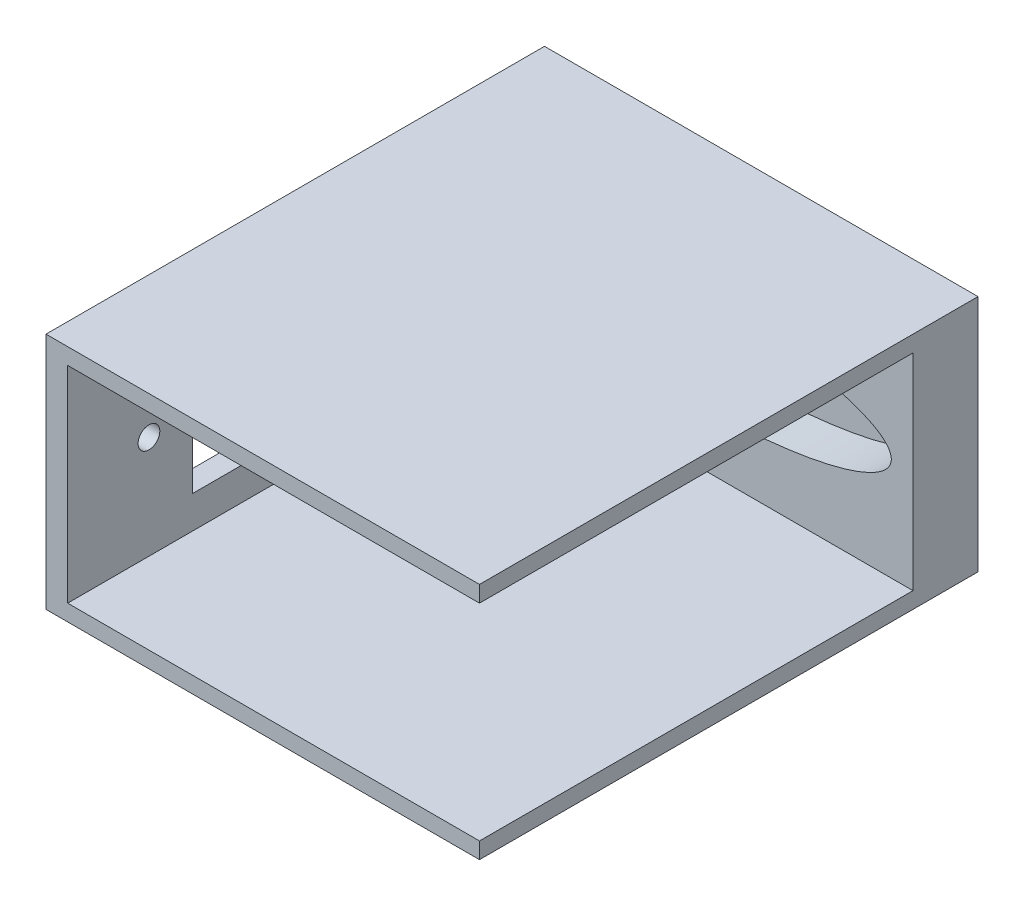
ISO-10303-21;
HEADER;
FILE_DESCRIPTION(('STEP AP214'),'2;1');
FILE_NAME('part.step','',(''),(''),'','','');
FILE_SCHEMA(('AUTOMOTIVE_DESIGN { 1 0 10303 214 1 1 1 1 }'));
ENDSEC;
DATA;
#1=APPLICATION_CONTEXT('core data for automotive mechanical design processes');
#2=APPLICATION_PROTOCOL_DEFINITION('international standard','automotive_design',2000,#1);
#3=PRODUCT_CONTEXT('',#1,'mechanical');
#4=PRODUCT('Part','Part','',(#3));
#5=PRODUCT_RELATED_PRODUCT_CATEGORY('part','',(#4));
#6=PRODUCT_DEFINITION_FORMATION('','',#4);
#7=PRODUCT_DEFINITION_CONTEXT('part definition',#1,'design');
#8=PRODUCT_DEFINITION('design','',#6,#7);
#9=PRODUCT_DEFINITION_SHAPE('','',#8);
#10=(LENGTH_UNIT() NAMED_UNIT(*) SI_UNIT(.MILLI.,.METRE.));
#11=(NAMED_UNIT(*) PLANE_ANGLE_UNIT() SI_UNIT($,.RADIAN.));
#12=(NAMED_UNIT(*) SI_UNIT($,.STERADIAN.) SOLID_ANGLE_UNIT());
#13=UNCERTAINTY_MEASURE_WITH_UNIT(LENGTH_MEASURE(1.E-05),#10,'distance_accuracy_value','');
#14=(GEOMETRIC_REPRESENTATION_CONTEXT(3) GLOBAL_UNCERTAINTY_ASSIGNED_CONTEXT((#13)) GLOBAL_UNIT_ASSIGNED_CONTEXT((#10,
#11,#12)) REPRESENTATION_CONTEXT('',''));
#15=CARTESIAN_POINT('',(0.,0.,0.));
#16=DIRECTION('',(0.,0.,1.));
#17=DIRECTION('',(1.,0.,0.));
#18=AXIS2_PLACEMENT_3D('',#15,#16,#17);
#19=CARTESIAN_POINT('',(0.,0.,6.));
#20=DIRECTION('',(0.,0.,1.));
#21=DIRECTION('',(1.,0.,0.));
#22=AXIS2_PLACEMENT_3D('',#19,#20,#21);
#23=PLANE('',#22);
#24=DIRECTION('',(0.,1.,0.));
#25=VECTOR('',#24,1.);
#26=CARTESIAN_POINT('',(20.,0.,6.));
#27=LINE('',#26,#25);
#28=CARTESIAN_POINT('',(20.,-9.5,6.));
#29=VERTEX_POINT('',#28);
#30=CARTESIAN_POINT('',(20.,9.5,6.));
#31=VERTEX_POINT('',#30);
#32=EDGE_CURVE('E311',#29,#31,#27,.T.);
#33=ORIENTED_EDGE('',*,*,#32,.T.);
#34=DIRECTION('',(-1.,0.,0.));
#35=VECTOR('',#34,1.);
#36=CARTESIAN_POINT('',(20.,9.5,6.));
#37=LINE('',#36,#35);
#38=CARTESIAN_POINT('',(0.,9.5,6.));
#39=VERTEX_POINT('',#38);
#40=EDGE_CURVE('E205',#31,#39,#37,.T.);
#41=ORIENTED_EDGE('',*,*,#40,.T.);
#42=CARTESIAN_POINT('',(0.,0.,6.));
#43=DIRECTION('',(0.,0.,1.));
#44=DIRECTION('',(0.,1.,0.));
#45=AXIS2_PLACEMENT_3D('',#42,#43,#44);
#46=ELLIPSE('',#45,9.5,4.5);
#47=CARTESIAN_POINT('',(3.99121071229722,4.38798243109834,6.));
#48=VERTEX_POINT('',#47);
#49=EDGE_CURVE('E269',#48,#39,#46,.T.);
#50=ORIENTED_EDGE('',*,*,#49,.F.);
#51=CARTESIAN_POINT('',(0.,0.,6.));
#52=DIRECTION('',(0.,0.,1.));
#53=DIRECTION('',(1.,0.,0.));
#54=AXIS2_PLACEMENT_3D('',#51,#52,#53);
#55=ELLIPSE('',#54,18.,4.5);
#56=CARTESIAN_POINT('',(3.99121071229722,-4.38798243109834,6.));
#57=VERTEX_POINT('',#56);
#58=EDGE_CURVE('E441',#57,#48,#55,.T.);
#59=ORIENTED_EDGE('',*,*,#58,.F.);
#60=CARTESIAN_POINT('',(0.,0.,6.));
#61=DIRECTION('',(0.,0.,1.));
#62=DIRECTION('',(0.,1.,0.));
#63=AXIS2_PLACEMENT_3D('',#60,#61,#62);
#64=ELLIPSE('',#63,9.5,4.5);
#65=CARTESIAN_POINT('',(0.,-9.5,6.));
#66=VERTEX_POINT('',#65);
#67=EDGE_CURVE('E436',#66,#57,#64,.T.);
#68=ORIENTED_EDGE('',*,*,#67,.F.);
#69=DIRECTION('',(-1.,0.,0.));
#70=VECTOR('',#69,1.);
#71=CARTESIAN_POINT('',(20.,-9.5,6.));
#72=LINE('',#71,#70);
#73=EDGE_CURVE('E195',#29,#66,#72,.T.);
#74=ORIENTED_EDGE('',*,*,#73,.F.);
#75=EDGE_LOOP('',(#33,#41,#50,#59,#68,#74));
#76=FACE_BOUND('',#75,.T.);
#77=ADVANCED_FACE('F39',(#76),#23,.T.);
#78=CARTESIAN_POINT('',(-3.99121071229722,4.38798243109834,6.));
#79=VERTEX_POINT('',#78);
#80=EDGE_CURVE('E445',#39,#79,#46,.T.);
#81=ORIENTED_EDGE('',*,*,#80,.F.);
#82=CARTESIAN_POINT('',(-18.,9.5,6.));
#83=VERTEX_POINT('',#82);
#84=EDGE_CURVE('E242',#39,#83,#37,.T.);
#85=ORIENTED_EDGE('',*,*,#84,.T.);
#86=DIRECTION('',(0.,1.,0.));
#87=VECTOR('',#86,1.);
#88=CARTESIAN_POINT('',(-18.,-9.5,6.));
#89=LINE('',#88,#87);
#90=CARTESIAN_POINT('',(-18.,0.,6.));
#91=VERTEX_POINT('',#90);
#92=EDGE_CURVE('E239',#91,#83,#89,.T.);
#93=ORIENTED_EDGE('',*,*,#92,.F.);
#94=CARTESIAN_POINT('',(0.,0.,6.));
#95=DIRECTION('',(0.,0.,1.));
#96=DIRECTION('',(1.,0.,0.));
#97=AXIS2_PLACEMENT_3D('',#94,#95,#96);
#98=ELLIPSE('',#97,18.,4.5);
#99=EDGE_CURVE('E432',#79,#91,#98,.T.);
#100=ORIENTED_EDGE('',*,*,#99,.F.);
#101=EDGE_LOOP('',(#81,#85,#93,#100));
#102=FACE_BOUND('',#101,.T.);
#103=ADVANCED_FACE('F286',(#102),#23,.T.);
#104=CARTESIAN_POINT('',(0.,-11.,6.));
#105=DIRECTION('',(0.,1.,0.));
#106=DIRECTION('',(0.,0.,1.));
#107=AXIS2_PLACEMENT_3D('',#104,#105,#106);
#108=PLANE('',#107);
#109=DIRECTION('',(1.,0.,0.));
#110=VECTOR('',#109,1.);
#111=CARTESIAN_POINT('',(0.,-11.,0.));
#112=LINE('',#111,#110);
#113=CARTESIAN_POINT('',(-20.,-11.,0.));
#114=VERTEX_POINT('',#113);
#115=CARTESIAN_POINT('',(20.,-11.,0.));
#116=VERTEX_POINT('',#115);
#117=EDGE_CURVE('E453',#114,#116,#112,.T.);
#118=ORIENTED_EDGE('',*,*,#117,.T.);
#119=DIRECTION('',(0.,0.,-1.));
#120=VECTOR('',#119,1.);
#121=CARTESIAN_POINT('',(20.,-11.,6.));
#122=LINE('',#121,#120);
#123=CARTESIAN_POINT('',(20.,-11.,46.));
#124=VERTEX_POINT('',#123);
#125=EDGE_CURVE('E336',#124,#116,#122,.T.);
#126=ORIENTED_EDGE('',*,*,#125,.F.);
#127=DIRECTION('',(-1.,0.,0.));
#128=VECTOR('',#127,1.);
#129=CARTESIAN_POINT('',(20.,-11.,46.));
#130=LINE('',#129,#128);
#131=CARTESIAN_POINT('',(-20.,-11.,46.));
#132=VERTEX_POINT('',#131);
#133=EDGE_CURVE('E209',#124,#132,#130,.T.);
#134=ORIENTED_EDGE('',*,*,#133,.T.);
#135=DIRECTION('',(0.,0.,-1.));
#136=VECTOR('',#135,1.);
#137=CARTESIAN_POINT('',(-20.,-11.,6.));
#138=LINE('',#137,#136);
#139=EDGE_CURVE('E318',#132,#114,#138,.T.);
#140=ORIENTED_EDGE('',*,*,#139,.T.);
#141=EDGE_LOOP('',(#118,#126,#134,#140));
#142=FACE_BOUND('',#141,.T.);
#143=ADVANCED_FACE('F41',(#142),#108,.F.);
#144=CARTESIAN_POINT('',(20.,0.,6.));
#145=DIRECTION('',(-1.,0.,0.));
#146=DIRECTION('',(0.,0.,1.));
#147=AXIS2_PLACEMENT_3D('',#144,#145,#146);
#148=PLANE('',#147);
#149=DIRECTION('',(0.,1.,0.));
#150=VECTOR('',#149,1.);
#151=CARTESIAN_POINT('',(20.,0.,0.));
#152=LINE('',#151,#150);
#153=CARTESIAN_POINT('',(20.,11.,0.));
#154=VERTEX_POINT('',#153);
#155=EDGE_CURVE('E466',#116,#154,#152,.T.);
#156=ORIENTED_EDGE('',*,*,#155,.T.);
#157=DIRECTION('',(0.,0.,-1.));
#158=VECTOR('',#157,1.);
#159=CARTESIAN_POINT('',(20.,11.,6.));
#160=LINE('',#159,#158);
#161=CARTESIAN_POINT('',(20.,11.,46.));
#162=VERTEX_POINT('',#161);
#163=EDGE_CURVE('E341',#162,#154,#160,.T.);
#164=ORIENTED_EDGE('',*,*,#163,.F.);
#165=DIRECTION('',(0.,-1.,0.));
#166=VECTOR('',#165,1.);
#167=CARTESIAN_POINT('',(20.,11.,46.));
#168=LINE('',#167,#166);
#169=CARTESIAN_POINT('',(20.,9.5,46.));
#170=VERTEX_POINT('',#169);
#171=EDGE_CURVE('E226',#162,#170,#168,.T.);
#172=ORIENTED_EDGE('',*,*,#171,.T.);
#173=DIRECTION('',(0.,0.,-1.));
#174=VECTOR('',#173,1.);
#175=CARTESIAN_POINT('',(20.,9.5,46.));
#176=LINE('',#175,#174);
#177=EDGE_CURVE('E230',#170,#31,#176,.T.);
#178=ORIENTED_EDGE('',*,*,#177,.T.);
#179=ORIENTED_EDGE('',*,*,#32,.F.);
#180=DIRECTION('',(0.,0.,-1.));
#181=VECTOR('',#180,1.);
#182=CARTESIAN_POINT('',(20.,-9.5,46.));
#183=LINE('',#182,#181);
#184=CARTESIAN_POINT('',(20.,-9.5,46.));
#185=VERTEX_POINT('',#184);
#186=EDGE_CURVE('E254',#185,#29,#183,.T.);
#187=ORIENTED_EDGE('',*,*,#186,.F.);
#188=DIRECTION('',(0.,1.,0.));
#189=VECTOR('',#188,1.);
#190=CARTESIAN_POINT('',(20.,-11.,46.));
#191=LINE('',#190,#189);
#192=EDGE_CURVE('E213',#124,#185,#191,.T.);
#193=ORIENTED_EDGE('',*,*,#192,.F.);
#194=ORIENTED_EDGE('',*,*,#125,.T.);
#195=EDGE_LOOP('',(#156,#164,#172,#178,#179,#187,#193,#194));
#196=FACE_BOUND('',#195,.T.);
#197=ADVANCED_FACE('F295',(#196),#148,.F.);
#198=CARTESIAN_POINT('',(0.,11.,6.));
#199=DIRECTION('',(0.,1.,0.));
#200=DIRECTION('',(0.,0.,1.));
#201=AXIS2_PLACEMENT_3D('',#198,#199,#200);
#202=PLANE('',#201);
#203=DIRECTION('',(1.,0.,0.));
#204=VECTOR('',#203,1.);
#205=CARTESIAN_POINT('',(0.,11.,0.));
#206=LINE('',#205,#204);
#207=CARTESIAN_POINT('',(-20.,11.,0.));
#208=VERTEX_POINT('',#207);
#209=EDGE_CURVE('E469',#208,#154,#206,.T.);
#210=ORIENTED_EDGE('',*,*,#209,.F.);
#211=DIRECTION('',(0.,0.,-1.));
#212=VECTOR('',#211,1.);
#213=CARTESIAN_POINT('',(-20.,11.,6.));
#214=LINE('',#213,#212);
#215=CARTESIAN_POINT('',(-20.,11.,46.));
#216=VERTEX_POINT('',#215);
#217=EDGE_CURVE('E346',#216,#208,#214,.T.);
#218=ORIENTED_EDGE('',*,*,#217,.F.);
#219=DIRECTION('',(-1.,0.,0.));
#220=VECTOR('',#219,1.);
#221=CARTESIAN_POINT('',(20.,11.,46.));
#222=LINE('',#221,#220);
#223=EDGE_CURVE('E200',#162,#216,#222,.T.);
#224=ORIENTED_EDGE('',*,*,#223,.F.);
#225=ORIENTED_EDGE('',*,*,#163,.T.);
#226=EDGE_LOOP('',(#210,#218,#224,#225));
#227=FACE_BOUND('',#226,.T.);
#228=ADVANCED_FACE('F292',(#227),#202,.T.);
#229=CARTESIAN_POINT('',(-20.,0.,6.));
#230=DIRECTION('',(-1.,0.,0.));
#231=DIRECTION('',(0.,0.,1.));
#232=AXIS2_PLACEMENT_3D('',#229,#230,#231);
#233=PLANE('',#232);
#234=CARTESIAN_POINT('',(-20.,0.,38.5));
#235=DIRECTION('',(-1.,0.,0.));
#236=DIRECTION('',(0.,0.,1.));
#237=AXIS2_PLACEMENT_3D('',#234,#235,#236);
#238=CIRCLE('',#237,0.999999999999998);
#239=CARTESIAN_POINT('',(-20.,0.,39.5));
#240=VERTEX_POINT('',#239);
#241=EDGE_CURVE('E360',#240,#240,#238,.T.);
#242=ORIENTED_EDGE('',*,*,#241,.F.);
#243=EDGE_LOOP('',(#242));
#244=FACE_BOUND('',#243,.T.);
#245=CARTESIAN_POINT('',(-20.,0.,7.49999999999999));
#246=DIRECTION('',(-1.,0.,0.));
#247=DIRECTION('',(0.,0.,-1.));
#248=AXIS2_PLACEMENT_3D('',#245,#246,#247);
#249=CIRCLE('',#248,0.999999999999998);
#250=CARTESIAN_POINT('',(-20.,0.,6.49999999999999));
#251=VERTEX_POINT('',#250);
#252=EDGE_CURVE('E367',#251,#251,#249,.T.);
#253=ORIENTED_EDGE('',*,*,#252,.F.);
#254=EDGE_LOOP('',(#253));
#255=FACE_BOUND('',#254,.T.);
#256=DIRECTION('',(0.,0.,-1.));
#257=VECTOR('',#256,1.);
#258=CARTESIAN_POINT('',(-20.,6.5,0.));
#259=LINE('',#258,#257);
#260=CARTESIAN_POINT('',(-20.,6.5,34.5));
#261=VERTEX_POINT('',#260);
#262=CARTESIAN_POINT('',(-20.,6.5,11.5));
#263=VERTEX_POINT('',#262);
#264=EDGE_CURVE('E57',#261,#263,#259,.T.);
#265=ORIENTED_EDGE('',*,*,#264,.F.);
#266=DIRECTION('',(0.,-1.,0.));
#267=VECTOR('',#266,1.);
#268=CARTESIAN_POINT('',(-20.,0.,34.5));
#269=LINE('',#268,#267);
#270=CARTESIAN_POINT('',(-20.,-6.5,34.5));
#271=VERTEX_POINT('',#270);
#272=EDGE_CURVE('E185',#261,#271,#269,.T.);
#273=ORIENTED_EDGE('',*,*,#272,.T.);
#274=DIRECTION('',(0.,0.,-1.));
#275=VECTOR('',#274,1.);
#276=CARTESIAN_POINT('',(-20.,-6.5,0.));
#277=LINE('',#276,#275);
#278=CARTESIAN_POINT('',(-20.,-6.5,11.5));
#279=VERTEX_POINT('',#278);
#280=EDGE_CURVE('E167',#271,#279,#277,.T.);
#281=ORIENTED_EDGE('',*,*,#280,.T.);
#282=DIRECTION('',(0.,-1.,0.));
#283=VECTOR('',#282,1.);
#284=CARTESIAN_POINT('',(-20.,0.,11.5));
#285=LINE('',#284,#283);
#286=EDGE_CURVE('E177',#263,#279,#285,.T.);
#287=ORIENTED_EDGE('',*,*,#286,.F.);
#288=EDGE_LOOP('',(#265,#273,#281,#287));
#289=FACE_BOUND('',#288,.T.);
#290=DIRECTION('',(0.,1.,0.));
#291=VECTOR('',#290,1.);
#292=CARTESIAN_POINT('',(-20.,0.,0.));
#293=LINE('',#292,#291);
#294=EDGE_CURVE('E319',#114,#208,#293,.T.);
#295=ORIENTED_EDGE('',*,*,#294,.F.);
#296=ORIENTED_EDGE('',*,*,#139,.F.);
#297=DIRECTION('',(0.,-1.,0.));
#298=VECTOR('',#297,1.);
#299=CARTESIAN_POINT('',(-20.,11.,46.));
#300=LINE('',#299,#298);
#301=EDGE_CURVE('E204',#216,#132,#300,.T.);
#302=ORIENTED_EDGE('',*,*,#301,.F.);
#303=ORIENTED_EDGE('',*,*,#217,.T.);
#304=EDGE_LOOP('',(#295,#296,#302,#303));
#305=FACE_BOUND('',#304,.T.);
#306=ADVANCED_FACE('F182',(#244,#255,#289,#305),#233,.T.);
#307=CARTESIAN_POINT('',(-18.,-9.5,6.));
#308=VERTEX_POINT('',#307);
#309=EDGE_CURVE('E234',#308,#91,#89,.T.);
#310=ORIENTED_EDGE('',*,*,#309,.F.);
#311=EDGE_CURVE('E235',#66,#308,#72,.T.);
#312=ORIENTED_EDGE('',*,*,#311,.F.);
#313=CARTESIAN_POINT('',(-3.99121071229722,-4.38798243109835,6.));
#314=VERTEX_POINT('',#313);
#315=EDGE_CURVE('E437',#314,#66,#64,.T.);
#316=ORIENTED_EDGE('',*,*,#315,.F.);
#317=EDGE_CURVE('E352',#91,#314,#98,.T.);
#318=ORIENTED_EDGE('',*,*,#317,.F.);
#319=EDGE_LOOP('',(#310,#312,#316,#318));
#320=FACE_BOUND('',#319,.T.);
#321=ADVANCED_FACE('F282',(#320),#23,.T.);
#322=CARTESIAN_POINT('',(0.,0.,0.));
#323=DIRECTION('',(0.,0.,1.));
#324=DIRECTION('',(1.,0.,0.));
#325=AXIS2_PLACEMENT_3D('',#322,#323,#324);
#326=PLANE('',#325);
#327=CARTESIAN_POINT('',(0.,0.,0.));
#328=DIRECTION('',(0.,0.,1.));
#329=DIRECTION('',(1.,0.,0.));
#330=AXIS2_PLACEMENT_3D('',#327,#328,#329);
#331=CIRCLE('',#330,4.5);
#332=CARTESIAN_POINT('',(4.5,0.,0.));
#333=VERTEX_POINT('',#332);
#334=EDGE_CURVE('E258',#333,#333,#331,.T.);
#335=ORIENTED_EDGE('',*,*,#334,.T.);
#336=EDGE_LOOP('',(#335));
#337=FACE_BOUND('',#336,.T.);
#338=ORIENTED_EDGE('',*,*,#117,.F.);
#339=ORIENTED_EDGE('',*,*,#294,.T.);
#340=ORIENTED_EDGE('',*,*,#209,.T.);
#341=ORIENTED_EDGE('',*,*,#155,.F.);
#342=EDGE_LOOP('',(#338,#339,#340,#341));
#343=FACE_BOUND('',#342,.T.);
#344=ADVANCED_FACE('F278',(#337,#343),#326,.F.);
#345=CARTESIAN_POINT('',(0.,0.,2.));
#346=DIRECTION('',(0.,0.,1.));
#347=DIRECTION('',(1.,0.,0.));
#348=AXIS2_PLACEMENT_3D('',#345,#346,#347);
#349=ELLIPSE('',#348,18.,4.5);
#350=DIRECTION('',(0.,0.,1.));
#351=VECTOR('',#350,1.);
#352=SURFACE_OF_LINEAR_EXTRUSION('',#349,#351);
#353=ORIENTED_EDGE('',*,*,#99,.T.);
#354=ORIENTED_EDGE('',*,*,#317,.T.);
#355=DIRECTION('',(0.,0.,1.));
#356=VECTOR('',#355,1.);
#357=CARTESIAN_POINT('',(-3.99121071229722,-4.38798243109835,2.));
#358=LINE('',#357,#356);
#359=CARTESIAN_POINT('',(-3.99121071229722,-4.38798243109835,2.));
#360=VERTEX_POINT('',#359);
#361=EDGE_CURVE('E429',#360,#314,#358,.T.);
#362=ORIENTED_EDGE('',*,*,#361,.F.);
#363=CARTESIAN_POINT('',(-3.99121071229722,4.38798243109834,2.));
#364=VERTEX_POINT('',#363);
#365=EDGE_CURVE('E263',#364,#360,#349,.T.);
#366=ORIENTED_EDGE('',*,*,#365,.F.);
#367=DIRECTION('',(0.,0.,1.));
#368=VECTOR('',#367,1.);
#369=CARTESIAN_POINT('',(-3.99121071229722,4.38798243109834,2.));
#370=LINE('',#369,#368);
#371=EDGE_CURVE('E449',#364,#79,#370,.T.);
#372=ORIENTED_EDGE('',*,*,#371,.T.);
#373=EDGE_LOOP('',(#353,#354,#362,#366,#372));
#374=FACE_BOUND('',#373,.T.);
#375=ADVANCED_FACE('F273',(#374),#352,.F.);
#376=CARTESIAN_POINT('',(0.,0.,2.));
#377=DIRECTION('',(0.,0.,1.));
#378=DIRECTION('',(0.,1.,0.));
#379=AXIS2_PLACEMENT_3D('',#376,#377,#378);
#380=ELLIPSE('',#379,9.5,4.5);
#381=DIRECTION('',(0.,0.,1.));
#382=VECTOR('',#381,1.);
#383=SURFACE_OF_LINEAR_EXTRUSION('',#380,#382);
#384=ORIENTED_EDGE('',*,*,#49,.T.);
#385=ORIENTED_EDGE('',*,*,#80,.T.);
#386=ORIENTED_EDGE('',*,*,#371,.F.);
#387=CARTESIAN_POINT('',(3.99121071229722,4.38798243109834,2.));
#388=VERTEX_POINT('',#387);
#389=EDGE_CURVE('E424',#388,#364,#380,.T.);
#390=ORIENTED_EDGE('',*,*,#389,.F.);
#391=DIRECTION('',(0.,0.,1.));
#392=VECTOR('',#391,1.);
#393=CARTESIAN_POINT('',(3.99121071229722,4.38798243109834,2.));
#394=LINE('',#393,#392);
#395=EDGE_CURVE('E454',#388,#48,#394,.T.);
#396=ORIENTED_EDGE('',*,*,#395,.T.);
#397=EDGE_LOOP('',(#384,#385,#386,#390,#396));
#398=FACE_BOUND('',#397,.T.);
#399=ADVANCED_FACE('F277',(#398),#383,.F.);
#400=CARTESIAN_POINT('',(0.,0.,2.));
#401=DIRECTION('',(0.,0.,1.));
#402=DIRECTION('',(1.,0.,0.));
#403=AXIS2_PLACEMENT_3D('',#400,#401,#402);
#404=ELLIPSE('',#403,18.,4.5);
#405=DIRECTION('',(0.,0.,1.));
#406=VECTOR('',#405,1.);
#407=SURFACE_OF_LINEAR_EXTRUSION('',#404,#406);
#408=ORIENTED_EDGE('',*,*,#58,.T.);
#409=ORIENTED_EDGE('',*,*,#395,.F.);
#410=CARTESIAN_POINT('',(3.99121071229722,-4.38798243109834,2.));
#411=VERTEX_POINT('',#410);
#412=EDGE_CURVE('E430',#411,#388,#404,.T.);
#413=ORIENTED_EDGE('',*,*,#412,.F.);
#414=DIRECTION('',(0.,0.,1.));
#415=VECTOR('',#414,1.);
#416=CARTESIAN_POINT('',(3.99121071229722,-4.38798243109834,2.));
#417=LINE('',#416,#415);
#418=EDGE_CURVE('E457',#411,#57,#417,.T.);
#419=ORIENTED_EDGE('',*,*,#418,.T.);
#420=EDGE_LOOP('',(#408,#409,#413,#419));
#421=FACE_BOUND('',#420,.T.);
#422=ADVANCED_FACE('F422',(#421),#407,.F.);
#423=CARTESIAN_POINT('',(0.,0.,2.));
#424=DIRECTION('',(0.,0.,1.));
#425=DIRECTION('',(0.,1.,0.));
#426=AXIS2_PLACEMENT_3D('',#423,#424,#425);
#427=ELLIPSE('',#426,9.5,4.5);
#428=DIRECTION('',(0.,0.,1.));
#429=VECTOR('',#428,1.);
#430=SURFACE_OF_LINEAR_EXTRUSION('',#427,#429);
#431=ORIENTED_EDGE('',*,*,#315,.T.);
#432=ORIENTED_EDGE('',*,*,#67,.T.);
#433=ORIENTED_EDGE('',*,*,#418,.F.);
#434=EDGE_CURVE('E268',#360,#411,#427,.T.);
#435=ORIENTED_EDGE('',*,*,#434,.F.);
#436=ORIENTED_EDGE('',*,*,#361,.T.);
#437=EDGE_LOOP('',(#431,#432,#433,#435,#436));
#438=FACE_BOUND('',#437,.T.);
#439=ADVANCED_FACE('F280',(#438),#430,.F.);
#440=CARTESIAN_POINT('',(0.,0.,2.));
#441=DIRECTION('',(0.,0.,1.));
#442=DIRECTION('',(1.,0.,0.));
#443=AXIS2_PLACEMENT_3D('',#440,#441,#442);
#444=PLANE('',#443);
#445=CARTESIAN_POINT('',(0.,0.,2.));
#446=DIRECTION('',(0.,0.,1.));
#447=DIRECTION('',(1.,0.,0.));
#448=AXIS2_PLACEMENT_3D('',#445,#446,#447);
#449=CIRCLE('',#448,4.5);
#450=CARTESIAN_POINT('',(4.5,0.,2.));
#451=VERTEX_POINT('',#450);
#452=EDGE_CURVE('E262',#451,#451,#449,.T.);
#453=ORIENTED_EDGE('',*,*,#452,.F.);
#454=EDGE_LOOP('',(#453));
#455=FACE_BOUND('',#454,.T.);
#456=ORIENTED_EDGE('',*,*,#365,.T.);
#457=ORIENTED_EDGE('',*,*,#434,.T.);
#458=ORIENTED_EDGE('',*,*,#412,.T.);
#459=ORIENTED_EDGE('',*,*,#389,.T.);
#460=EDGE_LOOP('',(#456,#457,#458,#459));
#461=FACE_BOUND('',#460,.T.);
#462=ADVANCED_FACE('F415',(#455,#461),#444,.T.);
#463=CARTESIAN_POINT('',(0.,0.,0.));
#464=DIRECTION('',(0.,0.,1.));
#465=DIRECTION('',(1.,0.,0.));
#466=AXIS2_PLACEMENT_3D('',#463,#464,#465);
#467=CYLINDRICAL_SURFACE('',#466,4.5);
#468=ORIENTED_EDGE('',*,*,#452,.T.);
#469=EDGE_LOOP('',(#468));
#470=FACE_BOUND('',#469,.T.);
#471=ORIENTED_EDGE('',*,*,#334,.F.);
#472=EDGE_LOOP('',(#471));
#473=FACE_BOUND('',#472,.T.);
#474=ADVANCED_FACE('F412',(#470,#473),#467,.F.);
#475=CARTESIAN_POINT('',(20.,-9.5,46.));
#476=DIRECTION('',(0.,-1.,0.));
#477=DIRECTION('',(1.,0.,0.));
#478=AXIS2_PLACEMENT_3D('',#475,#476,#477);
#479=PLANE('',#478);
#480=ORIENTED_EDGE('',*,*,#73,.T.);
#481=ORIENTED_EDGE('',*,*,#311,.T.);
#482=DIRECTION('',(0.,0.,-1.));
#483=VECTOR('',#482,1.);
#484=CARTESIAN_POINT('',(-18.,-9.5,46.));
#485=LINE('',#484,#483);
#486=CARTESIAN_POINT('',(-18.,-9.5,46.));
#487=VERTEX_POINT('',#486);
#488=EDGE_CURVE('E250',#487,#308,#485,.T.);
#489=ORIENTED_EDGE('',*,*,#488,.F.);
#490=DIRECTION('',(-1.,0.,0.));
#491=VECTOR('',#490,1.);
#492=CARTESIAN_POINT('',(20.,-9.5,46.));
#493=LINE('',#492,#491);
#494=EDGE_CURVE('E216',#185,#487,#493,.T.);
#495=ORIENTED_EDGE('',*,*,#494,.F.);
#496=ORIENTED_EDGE('',*,*,#186,.T.);
#497=EDGE_LOOP('',(#480,#481,#489,#495,#496));
#498=FACE_BOUND('',#497,.T.);
#499=ADVANCED_FACE('F408',(#498),#479,.F.);
#500=CARTESIAN_POINT('',(-18.,-9.5,46.));
#501=DIRECTION('',(-1.,0.,0.));
#502=DIRECTION('',(0.,0.,1.));
#503=AXIS2_PLACEMENT_3D('',#500,#501,#502);
#504=PLANE('',#503);
#505=CARTESIAN_POINT('',(-18.,0.,38.5));
#506=DIRECTION('',(-1.,0.,0.));
#507=DIRECTION('',(0.,0.,1.));
#508=AXIS2_PLACEMENT_3D('',#505,#506,#507);
#509=CIRCLE('',#508,0.999999999999998);
#510=CARTESIAN_POINT('',(-18.,0.,39.5));
#511=VERTEX_POINT('',#510);
#512=EDGE_CURVE('E43',#511,#511,#509,.T.);
#513=ORIENTED_EDGE('',*,*,#512,.T.);
#514=EDGE_LOOP('',(#513));
#515=FACE_BOUND('',#514,.T.);
#516=CARTESIAN_POINT('',(-18.,0.,7.49999999999999));
#517=DIRECTION('',(-1.,0.,0.));
#518=DIRECTION('',(0.,0.,1.));
#519=AXIS2_PLACEMENT_3D('',#516,#517,#518);
#520=CIRCLE('',#519,0.999999999999998);
#521=CARTESIAN_POINT('',(-18.,0.,8.49999999999999));
#522=VERTEX_POINT('',#521);
#523=EDGE_CURVE('E357',#522,#522,#520,.T.);
#524=ORIENTED_EDGE('',*,*,#523,.T.);
#525=EDGE_LOOP('',(#524));
#526=FACE_BOUND('',#525,.T.);
#527=DIRECTION('',(0.,-1.,0.));
#528=VECTOR('',#527,1.);
#529=CARTESIAN_POINT('',(-18.,-9.5,34.5));
#530=LINE('',#529,#528);
#531=CARTESIAN_POINT('',(-18.,6.5,34.5));
#532=VERTEX_POINT('',#531);
#533=CARTESIAN_POINT('',(-18.,-6.5,34.5));
#534=VERTEX_POINT('',#533);
#535=EDGE_CURVE('E49',#532,#534,#530,.T.);
#536=ORIENTED_EDGE('',*,*,#535,.F.);
#537=DIRECTION('',(0.,0.,-1.));
#538=VECTOR('',#537,1.);
#539=CARTESIAN_POINT('',(-18.,6.5,46.));
#540=LINE('',#539,#538);
#541=CARTESIAN_POINT('',(-18.,6.5,11.5));
#542=VERTEX_POINT('',#541);
#543=EDGE_CURVE('E11',#532,#542,#540,.T.);
#544=ORIENTED_EDGE('',*,*,#543,.T.);
#545=DIRECTION('',(0.,-1.,0.));
#546=VECTOR('',#545,1.);
#547=CARTESIAN_POINT('',(-18.,-9.5,11.5));
#548=LINE('',#547,#546);
#549=CARTESIAN_POINT('',(-18.,-6.5,11.5));
#550=VERTEX_POINT('',#549);
#551=EDGE_CURVE('E329',#542,#550,#548,.T.);
#552=ORIENTED_EDGE('',*,*,#551,.T.);
#553=DIRECTION('',(0.,0.,-1.));
#554=VECTOR('',#553,1.);
#555=CARTESIAN_POINT('',(-18.,-6.5,46.));
#556=LINE('',#555,#554);
#557=EDGE_CURVE('E170',#534,#550,#556,.T.);
#558=ORIENTED_EDGE('',*,*,#557,.F.);
#559=EDGE_LOOP('',(#536,#544,#552,#558));
#560=FACE_BOUND('',#559,.T.);
#561=ORIENTED_EDGE('',*,*,#309,.T.);
#562=ORIENTED_EDGE('',*,*,#92,.T.);
#563=DIRECTION('',(0.,0.,-1.));
#564=VECTOR('',#563,1.);
#565=CARTESIAN_POINT('',(-18.,9.5,46.));
#566=LINE('',#565,#564);
#567=CARTESIAN_POINT('',(-18.,9.5,46.));
#568=VERTEX_POINT('',#567);
#569=EDGE_CURVE('E246',#568,#83,#566,.T.);
#570=ORIENTED_EDGE('',*,*,#569,.F.);
#571=DIRECTION('',(0.,1.,0.));
#572=VECTOR('',#571,1.);
#573=CARTESIAN_POINT('',(-18.,-9.5,46.));
#574=LINE('',#573,#572);
#575=EDGE_CURVE('E219',#487,#568,#574,.T.);
#576=ORIENTED_EDGE('',*,*,#575,.F.);
#577=ORIENTED_EDGE('',*,*,#488,.T.);
#578=EDGE_LOOP('',(#561,#562,#570,#576,#577));
#579=FACE_BOUND('',#578,.T.);
#580=ADVANCED_FACE('F405',(#515,#526,#560,#579),#504,.F.);
#581=CARTESIAN_POINT('',(20.,9.5,46.));
#582=DIRECTION('',(0.,-1.,0.));
#583=DIRECTION('',(1.,0.,0.));
#584=AXIS2_PLACEMENT_3D('',#581,#582,#583);
#585=PLANE('',#584);
#586=ORIENTED_EDGE('',*,*,#40,.F.);
#587=ORIENTED_EDGE('',*,*,#177,.F.);
#588=DIRECTION('',(-1.,0.,0.));
#589=VECTOR('',#588,1.);
#590=CARTESIAN_POINT('',(20.,9.5,46.));
#591=LINE('',#590,#589);
#592=EDGE_CURVE('E222',#170,#568,#591,.T.);
#593=ORIENTED_EDGE('',*,*,#592,.T.);
#594=ORIENTED_EDGE('',*,*,#569,.T.);
#595=ORIENTED_EDGE('',*,*,#84,.F.);
#596=EDGE_LOOP('',(#586,#587,#593,#594,#595));
#597=FACE_BOUND('',#596,.T.);
#598=ADVANCED_FACE('F325',(#597),#585,.T.);
#599=CARTESIAN_POINT('',(0.,0.,46.));
#600=DIRECTION('',(0.,0.,1.));
#601=DIRECTION('',(1.,0.,0.));
#602=AXIS2_PLACEMENT_3D('',#599,#600,#601);
#603=PLANE('',#602);
#604=ORIENTED_EDGE('',*,*,#223,.T.);
#605=ORIENTED_EDGE('',*,*,#301,.T.);
#606=ORIENTED_EDGE('',*,*,#133,.F.);
#607=ORIENTED_EDGE('',*,*,#192,.T.);
#608=ORIENTED_EDGE('',*,*,#494,.T.);
#609=ORIENTED_EDGE('',*,*,#575,.T.);
#610=ORIENTED_EDGE('',*,*,#592,.F.);
#611=ORIENTED_EDGE('',*,*,#171,.F.);
#612=EDGE_LOOP('',(#604,#605,#606,#607,#608,#609,#610,#611));
#613=FACE_BOUND('',#612,.T.);
#614=ADVANCED_FACE('F399',(#613),#603,.T.);
#615=CARTESIAN_POINT('',(20.,6.5,0.));
#616=DIRECTION('',(0.,1.,0.));
#617=DIRECTION('',(0.,0.,1.));
#618=AXIS2_PLACEMENT_3D('',#615,#616,#617);
#619=PLANE('',#618);
#620=DIRECTION('',(-1.,0.,0.));
#621=VECTOR('',#620,1.);
#622=CARTESIAN_POINT('',(20.,6.5,34.5));
#623=LINE('',#622,#621);
#624=EDGE_CURVE('E192',#532,#261,#623,.T.);
#625=ORIENTED_EDGE('',*,*,#624,.T.);
#626=ORIENTED_EDGE('',*,*,#264,.T.);
#627=DIRECTION('',(-1.,0.,0.));
#628=VECTOR('',#627,1.);
#629=CARTESIAN_POINT('',(20.,6.5,11.5));
#630=LINE('',#629,#628);
#631=EDGE_CURVE('E174',#542,#263,#630,.T.);
#632=ORIENTED_EDGE('',*,*,#631,.F.);
#633=ORIENTED_EDGE('',*,*,#543,.F.);
#634=EDGE_LOOP('',(#625,#626,#632,#633));
#635=FACE_BOUND('',#634,.T.);
#636=ADVANCED_FACE('F393',(#635),#619,.F.);
#637=CARTESIAN_POINT('',(20.,0.,34.5));
#638=DIRECTION('',(0.,0.,-1.));
#639=DIRECTION('',(-1.,0.,0.));
#640=AXIS2_PLACEMENT_3D('',#637,#638,#639);
#641=PLANE('',#640);
#642=ORIENTED_EDGE('',*,*,#535,.T.);
#643=DIRECTION('',(-1.,0.,0.));
#644=VECTOR('',#643,1.);
#645=CARTESIAN_POINT('',(20.,-6.5,34.5));
#646=LINE('',#645,#644);
#647=EDGE_CURVE('E173',#534,#271,#646,.T.);
#648=ORIENTED_EDGE('',*,*,#647,.T.);
#649=ORIENTED_EDGE('',*,*,#272,.F.);
#650=ORIENTED_EDGE('',*,*,#624,.F.);
#651=EDGE_LOOP('',(#642,#648,#649,#650));
#652=FACE_BOUND('',#651,.T.);
#653=ADVANCED_FACE('F390',(#652),#641,.T.);
#654=CARTESIAN_POINT('',(20.,-6.5,0.));
#655=DIRECTION('',(0.,1.,0.));
#656=DIRECTION('',(0.,0.,1.));
#657=AXIS2_PLACEMENT_3D('',#654,#655,#656);
#658=PLANE('',#657);
#659=ORIENTED_EDGE('',*,*,#557,.T.);
#660=DIRECTION('',(-1.,0.,0.));
#661=VECTOR('',#660,1.);
#662=CARTESIAN_POINT('',(20.,-6.5,11.5));
#663=LINE('',#662,#661);
#664=EDGE_CURVE('E65',#550,#279,#663,.T.);
#665=ORIENTED_EDGE('',*,*,#664,.T.);
#666=ORIENTED_EDGE('',*,*,#280,.F.);
#667=ORIENTED_EDGE('',*,*,#647,.F.);
#668=EDGE_LOOP('',(#659,#665,#666,#667));
#669=FACE_BOUND('',#668,.T.);
#670=ADVANCED_FACE('F164',(#669),#658,.T.);
#671=CARTESIAN_POINT('',(20.,0.,11.5));
#672=DIRECTION('',(0.,0.,-1.));
#673=DIRECTION('',(-1.,0.,0.));
#674=AXIS2_PLACEMENT_3D('',#671,#672,#673);
#675=PLANE('',#674);
#676=ORIENTED_EDGE('',*,*,#631,.T.);
#677=ORIENTED_EDGE('',*,*,#286,.T.);
#678=ORIENTED_EDGE('',*,*,#664,.F.);
#679=ORIENTED_EDGE('',*,*,#551,.F.);
#680=EDGE_LOOP('',(#676,#677,#678,#679));
#681=FACE_BOUND('',#680,.T.);
#682=ADVANCED_FACE('F178',(#681),#675,.F.);
#683=CARTESIAN_POINT('',(20.,0.,7.49999999999999));
#684=DIRECTION('',(-1.,0.,0.));
#685=DIRECTION('',(0.,0.,1.));
#686=AXIS2_PLACEMENT_3D('',#683,#684,#685);
#687=CYLINDRICAL_SURFACE('',#686,0.999999999999998);
#688=ORIENTED_EDGE('',*,*,#252,.T.);
#689=EDGE_LOOP('',(#688));
#690=FACE_BOUND('',#689,.T.);
#691=ORIENTED_EDGE('',*,*,#523,.F.);
#692=EDGE_LOOP('',(#691));
#693=FACE_BOUND('',#692,.T.);
#694=ADVANCED_FACE('F377',(#690,#693),#687,.F.);
#695=CARTESIAN_POINT('',(20.,0.,38.5));
#696=DIRECTION('',(-1.,0.,0.));
#697=DIRECTION('',(0.,0.,1.));
#698=AXIS2_PLACEMENT_3D('',#695,#696,#697);
#699=CYLINDRICAL_SURFACE('',#698,0.999999999999998);
#700=ORIENTED_EDGE('',*,*,#241,.T.);
#701=EDGE_LOOP('',(#700));
#702=FACE_BOUND('',#701,.T.);
#703=ORIENTED_EDGE('',*,*,#512,.F.);
#704=EDGE_LOOP('',(#703));
#705=FACE_BOUND('',#704,.T.);
#706=ADVANCED_FACE('F381',(#702,#705),#699,.F.);
#707=CLOSED_SHELL('',(#77,#103,#143,#197,#228,#306,#321,#344,#375,#399,#422,#439,#462,#474,#499,
#580,#598,#614,#636,#653,#670,#682,#694,#706));
#708=MANIFOLD_SOLID_BREP('B2',#707);
#709=ADVANCED_BREP_SHAPE_REPRESENTATION('',(#18,#708),#14);
#710=SHAPE_DEFINITION_REPRESENTATION(#9,#709);
ENDSEC;
END-ISO-10303-21;
